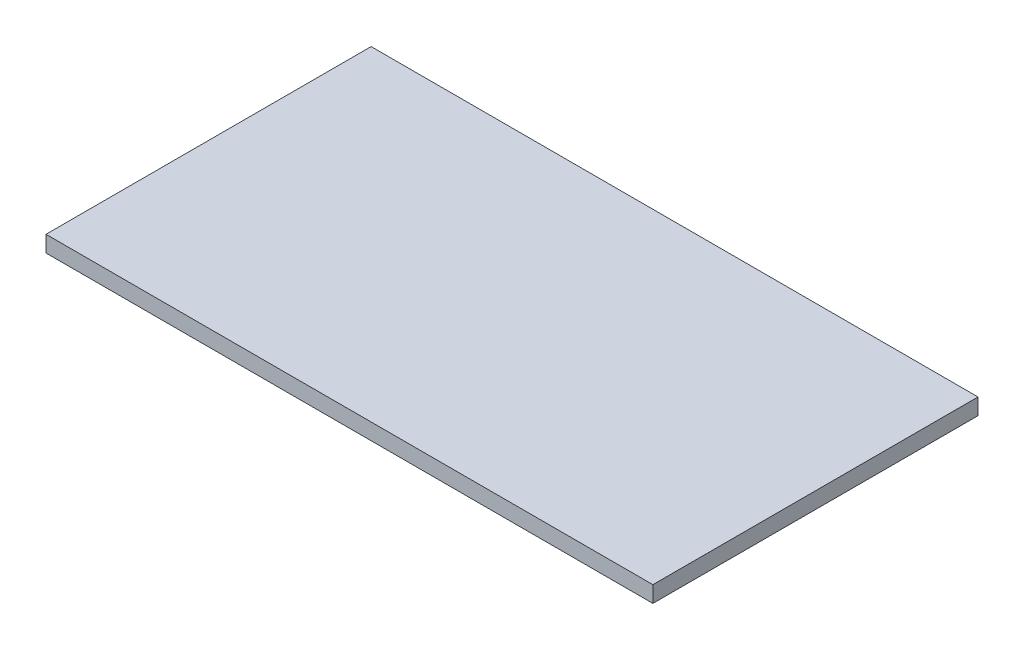
ISO-10303-21;
HEADER;
FILE_DESCRIPTION(('STEP AP214'),'2;1');
FILE_NAME('part.step','',(''),(''),'','','');
FILE_SCHEMA(('AUTOMOTIVE_DESIGN { 1 0 10303 214 1 1 1 1 }'));
ENDSEC;
DATA;
#1=APPLICATION_CONTEXT('core data for automotive mechanical design processes');
#2=APPLICATION_PROTOCOL_DEFINITION('international standard','automotive_design',2000,#1);
#3=PRODUCT_CONTEXT('',#1,'mechanical');
#4=PRODUCT('Part','Part','',(#3));
#5=PRODUCT_RELATED_PRODUCT_CATEGORY('part','',(#4));
#6=PRODUCT_DEFINITION_FORMATION('','',#4);
#7=PRODUCT_DEFINITION_CONTEXT('part definition',#1,'design');
#8=PRODUCT_DEFINITION('design','',#6,#7);
#9=PRODUCT_DEFINITION_SHAPE('','',#8);
#10=(LENGTH_UNIT() NAMED_UNIT(*) SI_UNIT(.MILLI.,.METRE.));
#11=(NAMED_UNIT(*) PLANE_ANGLE_UNIT() SI_UNIT($,.RADIAN.));
#12=(NAMED_UNIT(*) SI_UNIT($,.STERADIAN.) SOLID_ANGLE_UNIT());
#13=UNCERTAINTY_MEASURE_WITH_UNIT(LENGTH_MEASURE(1.E-05),#10,'distance_accuracy_value','');
#14=(GEOMETRIC_REPRESENTATION_CONTEXT(3) GLOBAL_UNCERTAINTY_ASSIGNED_CONTEXT((#13)) GLOBAL_UNIT_ASSIGNED_CONTEXT((#10,
#11,#12)) REPRESENTATION_CONTEXT('',''));
#15=CARTESIAN_POINT('',(0.,0.,0.));
#16=DIRECTION('',(0.,0.,1.));
#17=DIRECTION('',(1.,0.,0.));
#18=AXIS2_PLACEMENT_3D('',#15,#16,#17);
#19=CARTESIAN_POINT('',(-280.,15.,166.));
#20=DIRECTION('',(1.,0.,0.));
#21=DIRECTION('',(0.,0.,-1.));
#22=AXIS2_PLACEMENT_3D('',#19,#20,#21);
#23=PLANE('',#22);
#24=DIRECTION('',(0.,0.,1.));
#25=VECTOR('',#24,1.);
#26=CARTESIAN_POINT('',(-280.,0.,166.));
#27=LINE('',#26,#25);
#28=CARTESIAN_POINT('',(-280.,0.,-134.));
#29=VERTEX_POINT('',#28);
#30=CARTESIAN_POINT('',(-280.,0.,166.));
#31=VERTEX_POINT('',#30);
#32=EDGE_CURVE('E102',#29,#31,#27,.T.);
#33=ORIENTED_EDGE('',*,*,#32,.T.);
#34=DIRECTION('',(0.,-1.,0.));
#35=VECTOR('',#34,1.);
#36=CARTESIAN_POINT('',(-280.,15.,166.));
#37=LINE('',#36,#35);
#38=CARTESIAN_POINT('',(-280.,15.,166.));
#39=VERTEX_POINT('',#38);
#40=EDGE_CURVE('E11',#39,#31,#37,.T.);
#41=ORIENTED_EDGE('',*,*,#40,.F.);
#42=DIRECTION('',(0.,0.,1.));
#43=VECTOR('',#42,1.);
#44=CARTESIAN_POINT('',(-280.,15.,166.));
#45=LINE('',#44,#43);
#46=CARTESIAN_POINT('',(-280.,15.,-134.));
#47=VERTEX_POINT('',#46);
#48=EDGE_CURVE('E90',#47,#39,#45,.T.);
#49=ORIENTED_EDGE('',*,*,#48,.F.);
#50=DIRECTION('',(0.,-1.,0.));
#51=VECTOR('',#50,1.);
#52=CARTESIAN_POINT('',(-280.,15.,-134.));
#53=LINE('',#52,#51);
#54=EDGE_CURVE('E98',#47,#29,#53,.T.);
#55=ORIENTED_EDGE('',*,*,#54,.T.);
#56=EDGE_LOOP('',(#33,#41,#49,#55));
#57=FACE_BOUND('',#56,.T.);
#58=ADVANCED_FACE('F39',(#57),#23,.F.);
#59=CARTESIAN_POINT('',(-280.,15.,166.));
#60=DIRECTION('',(0.,0.,-1.));
#61=DIRECTION('',(-1.,0.,0.));
#62=AXIS2_PLACEMENT_3D('',#59,#60,#61);
#63=PLANE('',#62);
#64=DIRECTION('',(1.,0.,0.));
#65=VECTOR('',#64,1.);
#66=CARTESIAN_POINT('',(-280.,0.,166.));
#67=LINE('',#66,#65);
#68=CARTESIAN_POINT('',(280.,0.,166.));
#69=VERTEX_POINT('',#68);
#70=EDGE_CURVE('E94',#31,#69,#67,.T.);
#71=ORIENTED_EDGE('',*,*,#70,.T.);
#72=DIRECTION('',(0.,-1.,0.));
#73=VECTOR('',#72,1.);
#74=CARTESIAN_POINT('',(280.,15.,166.));
#75=LINE('',#74,#73);
#76=CARTESIAN_POINT('',(280.,15.,166.));
#77=VERTEX_POINT('',#76);
#78=EDGE_CURVE('E47',#77,#69,#75,.T.);
#79=ORIENTED_EDGE('',*,*,#78,.F.);
#80=DIRECTION('',(1.,0.,0.));
#81=VECTOR('',#80,1.);
#82=CARTESIAN_POINT('',(-280.,15.,166.));
#83=LINE('',#82,#81);
#84=EDGE_CURVE('E85',#39,#77,#83,.T.);
#85=ORIENTED_EDGE('',*,*,#84,.F.);
#86=ORIENTED_EDGE('',*,*,#40,.T.);
#87=EDGE_LOOP('',(#71,#79,#85,#86));
#88=FACE_BOUND('',#87,.T.);
#89=ADVANCED_FACE('F93',(#88),#63,.F.);
#90=CARTESIAN_POINT('',(280.,15.,166.));
#91=DIRECTION('',(-1.,0.,0.));
#92=DIRECTION('',(0.,0.,1.));
#93=AXIS2_PLACEMENT_3D('',#90,#91,#92);
#94=PLANE('',#93);
#95=DIRECTION('',(0.,0.,-1.));
#96=VECTOR('',#95,1.);
#97=CARTESIAN_POINT('',(280.,0.,166.));
#98=LINE('',#97,#96);
#99=CARTESIAN_POINT('',(280.,0.,-134.));
#100=VERTEX_POINT('',#99);
#101=EDGE_CURVE('E72',#69,#100,#98,.T.);
#102=ORIENTED_EDGE('',*,*,#101,.T.);
#103=DIRECTION('',(0.,-1.,0.));
#104=VECTOR('',#103,1.);
#105=CARTESIAN_POINT('',(280.,15.,-134.));
#106=LINE('',#105,#104);
#107=CARTESIAN_POINT('',(280.,15.,-134.));
#108=VERTEX_POINT('',#107);
#109=EDGE_CURVE('E95',#108,#100,#106,.T.);
#110=ORIENTED_EDGE('',*,*,#109,.F.);
#111=DIRECTION('',(0.,0.,-1.));
#112=VECTOR('',#111,1.);
#113=CARTESIAN_POINT('',(280.,15.,166.));
#114=LINE('',#113,#112);
#115=EDGE_CURVE('E88',#77,#108,#114,.T.);
#116=ORIENTED_EDGE('',*,*,#115,.F.);
#117=ORIENTED_EDGE('',*,*,#78,.T.);
#118=EDGE_LOOP('',(#102,#110,#116,#117));
#119=FACE_BOUND('',#118,.T.);
#120=ADVANCED_FACE('F96',(#119),#94,.F.);
#121=CARTESIAN_POINT('',(-280.,15.,-134.));
#122=DIRECTION('',(0.,0.,1.));
#123=DIRECTION('',(1.,0.,0.));
#124=AXIS2_PLACEMENT_3D('',#121,#122,#123);
#125=PLANE('',#124);
#126=DIRECTION('',(-1.,0.,0.));
#127=VECTOR('',#126,1.);
#128=CARTESIAN_POINT('',(-280.,0.,-134.));
#129=LINE('',#128,#127);
#130=EDGE_CURVE('E78',#100,#29,#129,.T.);
#131=ORIENTED_EDGE('',*,*,#130,.T.);
#132=ORIENTED_EDGE('',*,*,#54,.F.);
#133=DIRECTION('',(-1.,0.,0.));
#134=VECTOR('',#133,1.);
#135=CARTESIAN_POINT('',(-280.,15.,-134.));
#136=LINE('',#135,#134);
#137=EDGE_CURVE('E55',#108,#47,#136,.T.);
#138=ORIENTED_EDGE('',*,*,#137,.F.);
#139=ORIENTED_EDGE('',*,*,#109,.T.);
#140=EDGE_LOOP('',(#131,#132,#138,#139));
#141=FACE_BOUND('',#140,.T.);
#142=ADVANCED_FACE('F109',(#141),#125,.F.);
#143=CARTESIAN_POINT('',(0.,15.,0.));
#144=DIRECTION('',(0.,-1.,0.));
#145=DIRECTION('',(0.,0.,-1.));
#146=AXIS2_PLACEMENT_3D('',#143,#144,#145);
#147=PLANE('',#146);
#148=ORIENTED_EDGE('',*,*,#48,.T.);
#149=ORIENTED_EDGE('',*,*,#84,.T.);
#150=ORIENTED_EDGE('',*,*,#115,.T.);
#151=ORIENTED_EDGE('',*,*,#137,.T.);
#152=EDGE_LOOP('',(#148,#149,#150,#151));
#153=FACE_BOUND('',#152,.T.);
#154=ADVANCED_FACE('F86',(#153),#147,.F.);
#155=CARTESIAN_POINT('',(0.,0.,0.));
#156=DIRECTION('',(0.,-1.,0.));
#157=DIRECTION('',(0.,0.,-1.));
#158=AXIS2_PLACEMENT_3D('',#155,#156,#157);
#159=PLANE('',#158);
#160=ORIENTED_EDGE('',*,*,#32,.F.);
#161=ORIENTED_EDGE('',*,*,#130,.F.);
#162=ORIENTED_EDGE('',*,*,#101,.F.);
#163=ORIENTED_EDGE('',*,*,#70,.F.);
#164=EDGE_LOOP('',(#160,#161,#162,#163));
#165=FACE_BOUND('',#164,.T.);
#166=ADVANCED_FACE('F112',(#165),#159,.T.);
#167=CLOSED_SHELL('',(#58,#89,#120,#142,#154,#166));
#168=MANIFOLD_SOLID_BREP('B2',#167);
#169=ADVANCED_BREP_SHAPE_REPRESENTATION('',(#18,#168),#14);
#170=SHAPE_DEFINITION_REPRESENTATION(#9,#169);
ENDSEC;
END-ISO-10303-21;
